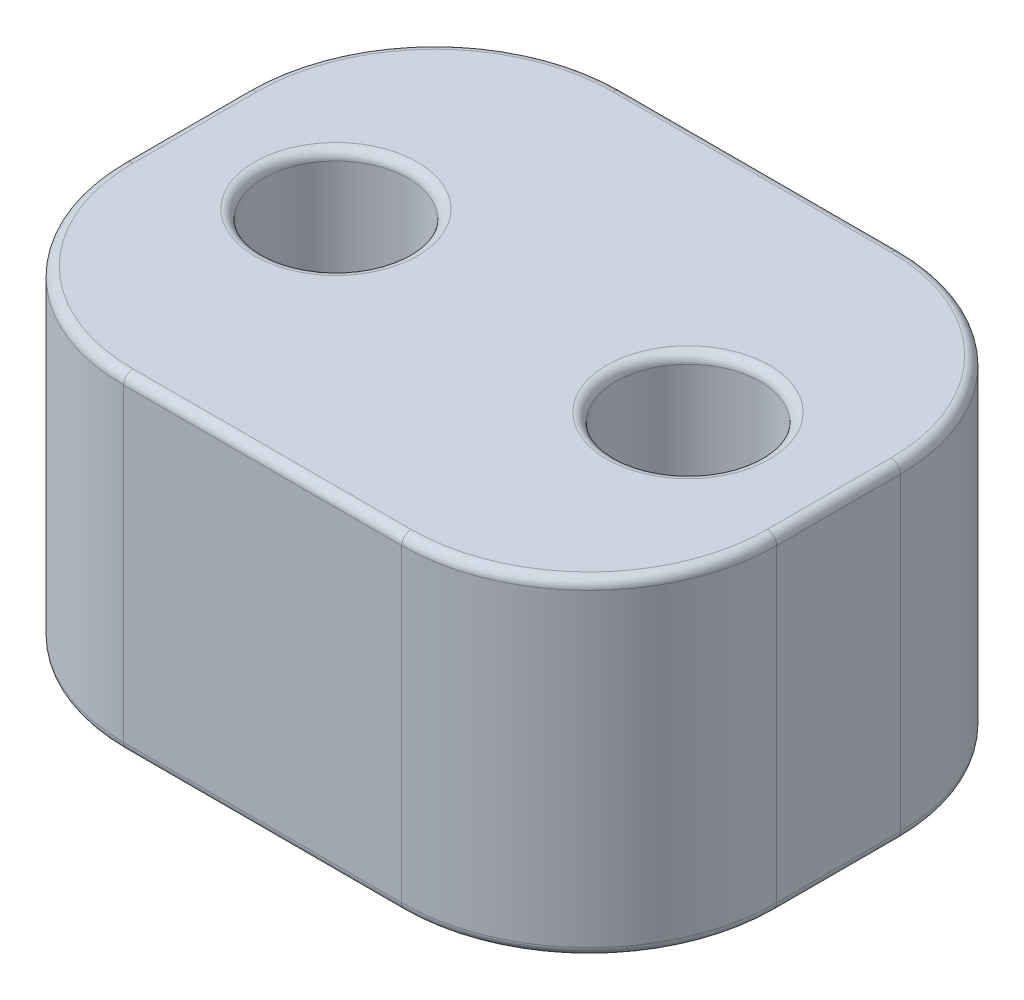
ISO-10303-21;
HEADER;
FILE_DESCRIPTION(('STEP AP214'),'2;1');
FILE_NAME('part.step','',(''),(''),'','','');
FILE_SCHEMA(('AUTOMOTIVE_DESIGN { 1 0 10303 214 1 1 1 1 }'));
ENDSEC;
DATA;
#1=APPLICATION_CONTEXT('core data for automotive mechanical design processes');
#2=APPLICATION_PROTOCOL_DEFINITION('international standard','automotive_design',2000,#1);
#3=PRODUCT_CONTEXT('',#1,'mechanical');
#4=PRODUCT('Part','Part','',(#3));
#5=PRODUCT_RELATED_PRODUCT_CATEGORY('part','',(#4));
#6=PRODUCT_DEFINITION_FORMATION('','',#4);
#7=PRODUCT_DEFINITION_CONTEXT('part definition',#1,'design');
#8=PRODUCT_DEFINITION('design','',#6,#7);
#9=PRODUCT_DEFINITION_SHAPE('','',#8);
#10=(LENGTH_UNIT() NAMED_UNIT(*) SI_UNIT(.MILLI.,.METRE.));
#11=(NAMED_UNIT(*) PLANE_ANGLE_UNIT() SI_UNIT($,.RADIAN.));
#12=(NAMED_UNIT(*) SI_UNIT($,.STERADIAN.) SOLID_ANGLE_UNIT());
#13=UNCERTAINTY_MEASURE_WITH_UNIT(LENGTH_MEASURE(1.E-05),#10,'distance_accuracy_value','');
#14=(GEOMETRIC_REPRESENTATION_CONTEXT(3) GLOBAL_UNCERTAINTY_ASSIGNED_CONTEXT((#13)) GLOBAL_UNIT_ASSIGNED_CONTEXT((#10,
#11,#12)) REPRESENTATION_CONTEXT('',''));
#15=CARTESIAN_POINT('',(0.,0.,0.));
#16=DIRECTION('',(0.,0.,1.));
#17=DIRECTION('',(1.,0.,0.));
#18=AXIS2_PLACEMENT_3D('',#15,#16,#17);
#19=CARTESIAN_POINT('',(0.939073469079084,0.825,2.73));
#20=DIRECTION('',(0.,-1.,0.));
#21=DIRECTION('',(0.,0.,-1.));
#22=AXIS2_PLACEMENT_3D('',#19,#20,#21);
#23=TOROIDAL_SURFACE('',#22,0.43452666740162,0.05);
#24=CARTESIAN_POINT('',(0.939073469079084,0.875,2.73));
#25=DIRECTION('',(0.,1.,0.));
#26=DIRECTION('',(1.,0.,0.));
#27=AXIS2_PLACEMENT_3D('',#24,#25,#26);
#28=CIRCLE('',#27,0.43452666740162);
#29=CARTESIAN_POINT('',(0.504546801677464,0.875,2.73));
#30=VERTEX_POINT('',#29);
#31=CARTESIAN_POINT('',(0.939073469079084,0.875,3.1645266674016));
#32=VERTEX_POINT('',#31);
#33=EDGE_CURVE('E11',#30,#32,#28,.T.);
#34=ORIENTED_EDGE('',*,*,#33,.T.);
#35=CARTESIAN_POINT('',(0.939073469079084,0.825,3.1645266674016));
#36=DIRECTION('',(-1.,0.,0.));
#37=DIRECTION('',(0.,0.,1.));
#38=AXIS2_PLACEMENT_3D('',#35,#36,#37);
#39=CIRCLE('',#38,0.05);
#40=CARTESIAN_POINT('',(0.939073469079084,0.825,3.1145266674016));
#41=VERTEX_POINT('',#40);
#42=EDGE_CURVE('E24',#32,#41,#39,.T.);
#43=ORIENTED_EDGE('',*,*,#42,.T.);
#44=CARTESIAN_POINT('',(0.939073469079084,0.825,2.73));
#45=DIRECTION('',(0.,-1.,0.));
#46=DIRECTION('',(1.,0.,0.));
#47=AXIS2_PLACEMENT_3D('',#44,#45,#46);
#48=CIRCLE('',#47,0.38452666740162);
#49=CARTESIAN_POINT('',(0.554546801677464,0.825,2.73));
#50=VERTEX_POINT('',#49);
#51=EDGE_CURVE('E396',#41,#50,#48,.T.);
#52=ORIENTED_EDGE('',*,*,#51,.T.);
#53=CARTESIAN_POINT('',(0.939073469079084,0.825,2.73));
#54=DIRECTION('',(0.,-1.,0.));
#55=DIRECTION('',(1.,0.,0.));
#56=AXIS2_PLACEMENT_3D('',#53,#54,#55);
#57=CIRCLE('',#56,0.38452666740162);
#58=EDGE_CURVE('E393',#50,#41,#57,.T.);
#59=ORIENTED_EDGE('',*,*,#58,.T.);
#60=ORIENTED_EDGE('',*,*,#42,.F.);
#61=CARTESIAN_POINT('',(0.939073469079084,0.875,2.73));
#62=DIRECTION('',(0.,1.,0.));
#63=DIRECTION('',(1.,0.,0.));
#64=AXIS2_PLACEMENT_3D('',#61,#62,#63);
#65=CIRCLE('',#64,0.43452666740162);
#66=EDGE_CURVE('E391',#32,#30,#65,.T.);
#67=ORIENTED_EDGE('',*,*,#66,.T.);
#68=EDGE_LOOP('',(#34,#43,#52,#59,#60,#67));
#69=FACE_BOUND('',#68,.T.);
#70=ADVANCED_FACE('F17',(#69),#23,.T.);
#71=CARTESIAN_POINT('',(0.939073469079084,0.,2.73));
#72=DIRECTION('',(0.,1.,0.));
#73=DIRECTION('',(1.,0.,0.));
#74=AXIS2_PLACEMENT_3D('',#71,#72,#73);
#75=CYLINDRICAL_SURFACE('',#74,0.38452666740162);
#76=ORIENTED_EDGE('',*,*,#58,.F.);
#77=DIRECTION('',(0.,-1.,0.));
#78=VECTOR('',#77,1.);
#79=CARTESIAN_POINT('',(0.554546801677464,0.,2.73));
#80=LINE('',#79,#78);
#81=CARTESIAN_POINT('',(0.554546801677464,-0.825,2.73));
#82=VERTEX_POINT('',#81);
#83=EDGE_CURVE('E389',#50,#82,#80,.T.);
#84=ORIENTED_EDGE('',*,*,#83,.T.);
#85=CARTESIAN_POINT('',(0.939073469079084,-0.825,2.73));
#86=DIRECTION('',(0.,1.,0.));
#87=DIRECTION('',(1.,0.,0.));
#88=AXIS2_PLACEMENT_3D('',#85,#86,#87);
#89=CIRCLE('',#88,0.38452666740162);
#90=CARTESIAN_POINT('',(0.939073469079084,-0.825,2.3454733325984));
#91=VERTEX_POINT('',#90);
#92=EDGE_CURVE('E386',#91,#82,#89,.T.);
#93=ORIENTED_EDGE('',*,*,#92,.F.);
#94=CARTESIAN_POINT('',(0.939073469079084,-0.825,2.73));
#95=DIRECTION('',(0.,1.,0.));
#96=DIRECTION('',(1.,0.,0.));
#97=AXIS2_PLACEMENT_3D('',#94,#95,#96);
#98=CIRCLE('',#97,0.38452666740162);
#99=EDGE_CURVE('E384',#82,#91,#98,.T.);
#100=ORIENTED_EDGE('',*,*,#99,.F.);
#101=ORIENTED_EDGE('',*,*,#83,.F.);
#102=ORIENTED_EDGE('',*,*,#51,.F.);
#103=EDGE_LOOP('',(#76,#84,#93,#100,#101,#102));
#104=FACE_BOUND('',#103,.T.);
#105=ADVANCED_FACE('F401',(#104),#75,.F.);
#106=CARTESIAN_POINT('',(0.,0.875,2.73));
#107=DIRECTION('',(0.,1.,0.));
#108=DIRECTION('',(0.,0.,1.));
#109=AXIS2_PLACEMENT_3D('',#106,#107,#108);
#110=PLANE('',#109);
#111=DIRECTION('',(0.,0.,-1.));
#112=VECTOR('',#111,1.);
#113=CARTESIAN_POINT('',(-1.6916886724432,0.875,2.565));
#114=LINE('',#113,#112);
#115=CARTESIAN_POINT('',(-1.6916886724432,0.875,3.06));
#116=VERTEX_POINT('',#115);
#117=CARTESIAN_POINT('',(-1.6916886724432,0.875,2.4));
#118=VERTEX_POINT('',#117);
#119=EDGE_CURVE('E382',#116,#118,#114,.T.);
#120=ORIENTED_EDGE('',*,*,#119,.F.);
#121=CARTESIAN_POINT('',(-0.741688672443182,0.875,3.06));
#122=DIRECTION('',(0.,-1.,0.));
#123=DIRECTION('',(-0.707106781186548,0.,0.707106781186547));
#124=AXIS2_PLACEMENT_3D('',#121,#122,#123);
#125=CIRCLE('',#124,0.95);
#126=CARTESIAN_POINT('',(-0.741688672443182,0.875,4.01));
#127=VERTEX_POINT('',#126);
#128=EDGE_CURVE('E379',#127,#116,#125,.T.);
#129=ORIENTED_EDGE('',*,*,#128,.F.);
#130=DIRECTION('',(-1.,0.,0.));
#131=VECTOR('',#130,1.);
#132=CARTESIAN_POINT('',(-0.370844336221591,0.875,4.01));
#133=LINE('',#132,#131);
#134=CARTESIAN_POINT('',(0.741688672443182,0.875,4.01));
#135=VERTEX_POINT('',#134);
#136=EDGE_CURVE('E376',#135,#127,#133,.T.);
#137=ORIENTED_EDGE('',*,*,#136,.F.);
#138=CARTESIAN_POINT('',(0.741688672443182,0.875,3.06));
#139=DIRECTION('',(0.,-1.,0.));
#140=DIRECTION('',(0.707106781186548,0.,0.707106781186547));
#141=AXIS2_PLACEMENT_3D('',#138,#139,#140);
#142=CIRCLE('',#141,0.95);
#143=CARTESIAN_POINT('',(1.6916886724432,0.875,3.06));
#144=VERTEX_POINT('',#143);
#145=EDGE_CURVE('E373',#144,#135,#142,.T.);
#146=ORIENTED_EDGE('',*,*,#145,.F.);
#147=DIRECTION('',(0.,0.,1.));
#148=VECTOR('',#147,1.);
#149=CARTESIAN_POINT('',(1.6916886724432,0.875,2.895));
#150=LINE('',#149,#148);
#151=CARTESIAN_POINT('',(1.6916886724432,0.875,2.4));
#152=VERTEX_POINT('',#151);
#153=EDGE_CURVE('E370',#152,#144,#150,.T.);
#154=ORIENTED_EDGE('',*,*,#153,.F.);
#155=CARTESIAN_POINT('',(0.741688672443182,0.875,2.4));
#156=DIRECTION('',(0.,-1.,0.));
#157=DIRECTION('',(0.707106781186548,0.,-0.707106781186548));
#158=AXIS2_PLACEMENT_3D('',#155,#156,#157);
#159=CIRCLE('',#158,0.95);
#160=CARTESIAN_POINT('',(0.741688672443182,0.875,1.45));
#161=VERTEX_POINT('',#160);
#162=EDGE_CURVE('E367',#161,#152,#159,.T.);
#163=ORIENTED_EDGE('',*,*,#162,.F.);
#164=DIRECTION('',(1.,0.,0.));
#165=VECTOR('',#164,1.);
#166=CARTESIAN_POINT('',(0.370844336221591,0.875,1.45));
#167=LINE('',#166,#165);
#168=CARTESIAN_POINT('',(-0.741688672443182,0.875,1.45));
#169=VERTEX_POINT('',#168);
#170=EDGE_CURVE('E364',#169,#161,#167,.T.);
#171=ORIENTED_EDGE('',*,*,#170,.F.);
#172=CARTESIAN_POINT('',(-0.741688672443182,0.875,2.4));
#173=DIRECTION('',(0.,-1.,0.));
#174=DIRECTION('',(-0.707106781186547,0.,-0.707106781186548));
#175=AXIS2_PLACEMENT_3D('',#172,#173,#174);
#176=CIRCLE('',#175,0.95);
#177=EDGE_CURVE('E361',#118,#169,#176,.T.);
#178=ORIENTED_EDGE('',*,*,#177,.F.);
#179=EDGE_LOOP('',(#120,#129,#137,#146,#154,#163,#171,#178));
#180=FACE_BOUND('',#179,.T.);
#181=CARTESIAN_POINT('',(-0.939073469079084,0.875,2.73));
#182=DIRECTION('',(0.,1.,0.));
#183=DIRECTION('',(1.,0.,0.));
#184=AXIS2_PLACEMENT_3D('',#181,#182,#183);
#185=CIRCLE('',#184,0.43452666740162);
#186=CARTESIAN_POINT('',(-1.3736001364807,0.875,2.73));
#187=VERTEX_POINT('',#186);
#188=CARTESIAN_POINT('',(-0.939073469079084,0.875,3.1645266674016));
#189=VERTEX_POINT('',#188);
#190=EDGE_CURVE('E359',#187,#189,#185,.T.);
#191=ORIENTED_EDGE('',*,*,#190,.F.);
#192=CARTESIAN_POINT('',(-0.939073469079084,0.875,2.73));
#193=DIRECTION('',(0.,1.,0.));
#194=DIRECTION('',(1.,0.,0.));
#195=AXIS2_PLACEMENT_3D('',#192,#193,#194);
#196=CIRCLE('',#195,0.43452666740162);
#197=EDGE_CURVE('E356',#189,#187,#196,.T.);
#198=ORIENTED_EDGE('',*,*,#197,.F.);
#199=EDGE_LOOP('',(#191,#198));
#200=FACE_BOUND('',#199,.T.);
#201=ORIENTED_EDGE('',*,*,#33,.F.);
#202=ORIENTED_EDGE('',*,*,#66,.F.);
#203=EDGE_LOOP('',(#201,#202));
#204=FACE_BOUND('',#203,.T.);
#205=ADVANCED_FACE('F422',(#180,#200,#204),#110,.T.);
#206=CARTESIAN_POINT('',(0.939073469079084,-0.825,2.73));
#207=DIRECTION('',(0.,1.,0.));
#208=DIRECTION('',(0.,0.,1.));
#209=AXIS2_PLACEMENT_3D('',#206,#207,#208);
#210=TOROIDAL_SURFACE('',#209,0.43452666740162,0.05);
#211=CARTESIAN_POINT('',(0.939073469079084,-0.875,2.73));
#212=DIRECTION('',(0.,-1.,0.));
#213=DIRECTION('',(1.,0.,0.));
#214=AXIS2_PLACEMENT_3D('',#211,#212,#213);
#215=CIRCLE('',#214,0.43452666740162);
#216=CARTESIAN_POINT('',(0.504546801677464,-0.875,2.73));
#217=VERTEX_POINT('',#216);
#218=CARTESIAN_POINT('',(0.939073469079084,-0.875,2.2954733325984));
#219=VERTEX_POINT('',#218);
#220=EDGE_CURVE('E354',#217,#219,#215,.T.);
#221=ORIENTED_EDGE('',*,*,#220,.T.);
#222=CARTESIAN_POINT('',(0.939073469079084,-0.825,2.2954733325984));
#223=DIRECTION('',(-1.,0.,0.));
#224=DIRECTION('',(0.,0.,-1.));
#225=AXIS2_PLACEMENT_3D('',#222,#223,#224);
#226=CIRCLE('',#225,0.05);
#227=EDGE_CURVE('E351',#219,#91,#226,.T.);
#228=ORIENTED_EDGE('',*,*,#227,.T.);
#229=ORIENTED_EDGE('',*,*,#92,.T.);
#230=ORIENTED_EDGE('',*,*,#99,.T.);
#231=ORIENTED_EDGE('',*,*,#227,.F.);
#232=CARTESIAN_POINT('',(0.939073469079084,-0.875,2.73));
#233=DIRECTION('',(0.,-1.,0.));
#234=DIRECTION('',(1.,0.,0.));
#235=AXIS2_PLACEMENT_3D('',#232,#233,#234);
#236=CIRCLE('',#235,0.43452666740162);
#237=EDGE_CURVE('E348',#219,#217,#236,.T.);
#238=ORIENTED_EDGE('',*,*,#237,.T.);
#239=EDGE_LOOP('',(#221,#228,#229,#230,#231,#238));
#240=FACE_BOUND('',#239,.T.);
#241=ADVANCED_FACE('F406',(#240),#210,.T.);
#242=CARTESIAN_POINT('',(0.,-0.875,2.73));
#243=DIRECTION('',(0.,1.,0.));
#244=DIRECTION('',(0.,0.,1.));
#245=AXIS2_PLACEMENT_3D('',#242,#243,#244);
#246=PLANE('',#245);
#247=DIRECTION('',(-1.,0.,0.));
#248=VECTOR('',#247,1.);
#249=CARTESIAN_POINT('',(0.370844336221591,-0.875,1.45));
#250=LINE('',#249,#248);
#251=CARTESIAN_POINT('',(0.741688672443182,-0.875,1.45));
#252=VERTEX_POINT('',#251);
#253=CARTESIAN_POINT('',(-0.741688672443182,-0.875,1.45));
#254=VERTEX_POINT('',#253);
#255=EDGE_CURVE('E346',#252,#254,#250,.T.);
#256=ORIENTED_EDGE('',*,*,#255,.F.);
#257=CARTESIAN_POINT('',(0.741688672443182,-0.875,2.4));
#258=DIRECTION('',(0.,1.,0.));
#259=DIRECTION('',(0.707106781186548,0.,-0.707106781186548));
#260=AXIS2_PLACEMENT_3D('',#257,#258,#259);
#261=CIRCLE('',#260,0.95);
#262=CARTESIAN_POINT('',(1.6916886724432,-0.875,2.4));
#263=VERTEX_POINT('',#262);
#264=EDGE_CURVE('E344',#263,#252,#261,.T.);
#265=ORIENTED_EDGE('',*,*,#264,.F.);
#266=DIRECTION('',(0.,0.,-1.));
#267=VECTOR('',#266,1.);
#268=CARTESIAN_POINT('',(1.6916886724432,-0.875,2.895));
#269=LINE('',#268,#267);
#270=CARTESIAN_POINT('',(1.6916886724432,-0.875,3.06));
#271=VERTEX_POINT('',#270);
#272=EDGE_CURVE('E180',#271,#263,#269,.T.);
#273=ORIENTED_EDGE('',*,*,#272,.F.);
#274=CARTESIAN_POINT('',(0.741688672443182,-0.875,3.06));
#275=DIRECTION('',(0.,1.,0.));
#276=DIRECTION('',(0.707106781186548,0.,0.707106781186547));
#277=AXIS2_PLACEMENT_3D('',#274,#275,#276);
#278=CIRCLE('',#277,0.95);
#279=CARTESIAN_POINT('',(0.741688672443182,-0.875,4.01));
#280=VERTEX_POINT('',#279);
#281=EDGE_CURVE('E340',#280,#271,#278,.T.);
#282=ORIENTED_EDGE('',*,*,#281,.F.);
#283=DIRECTION('',(1.,0.,0.));
#284=VECTOR('',#283,1.);
#285=CARTESIAN_POINT('',(-0.370844336221591,-0.875,4.01));
#286=LINE('',#285,#284);
#287=CARTESIAN_POINT('',(-0.741688672443182,-0.875,4.01));
#288=VERTEX_POINT('',#287);
#289=EDGE_CURVE('E337',#288,#280,#286,.T.);
#290=ORIENTED_EDGE('',*,*,#289,.F.);
#291=CARTESIAN_POINT('',(-0.741688672443182,-0.875,3.06));
#292=DIRECTION('',(0.,1.,0.));
#293=DIRECTION('',(-0.707106781186548,0.,0.707106781186547));
#294=AXIS2_PLACEMENT_3D('',#291,#292,#293);
#295=CIRCLE('',#294,0.95);
#296=CARTESIAN_POINT('',(-1.6916886724432,-0.875,3.06));
#297=VERTEX_POINT('',#296);
#298=EDGE_CURVE('E334',#297,#288,#295,.T.);
#299=ORIENTED_EDGE('',*,*,#298,.F.);
#300=DIRECTION('',(0.,0.,1.));
#301=VECTOR('',#300,1.);
#302=CARTESIAN_POINT('',(-1.6916886724432,-0.875,2.565));
#303=LINE('',#302,#301);
#304=CARTESIAN_POINT('',(-1.6916886724432,-0.875,2.4));
#305=VERTEX_POINT('',#304);
#306=EDGE_CURVE('E331',#305,#297,#303,.T.);
#307=ORIENTED_EDGE('',*,*,#306,.F.);
#308=CARTESIAN_POINT('',(-0.741688672443182,-0.875,2.4));
#309=DIRECTION('',(0.,1.,0.));
#310=DIRECTION('',(-0.707106781186547,0.,-0.707106781186548));
#311=AXIS2_PLACEMENT_3D('',#308,#309,#310);
#312=CIRCLE('',#311,0.95);
#313=EDGE_CURVE('E328',#254,#305,#312,.T.);
#314=ORIENTED_EDGE('',*,*,#313,.F.);
#315=EDGE_LOOP('',(#256,#265,#273,#282,#290,#299,#307,#314));
#316=FACE_BOUND('',#315,.T.);
#317=CARTESIAN_POINT('',(-0.939073469079084,-0.875,2.73));
#318=DIRECTION('',(0.,-1.,0.));
#319=DIRECTION('',(1.,0.,0.));
#320=AXIS2_PLACEMENT_3D('',#317,#318,#319);
#321=CIRCLE('',#320,0.43452666740162);
#322=CARTESIAN_POINT('',(-1.3736001364807,-0.875,2.73));
#323=VERTEX_POINT('',#322);
#324=CARTESIAN_POINT('',(-0.939073469079084,-0.875,2.2954733325984));
#325=VERTEX_POINT('',#324);
#326=EDGE_CURVE('E326',#323,#325,#321,.T.);
#327=ORIENTED_EDGE('',*,*,#326,.F.);
#328=CARTESIAN_POINT('',(-0.939073469079084,-0.875,2.73));
#329=DIRECTION('',(0.,-1.,0.));
#330=DIRECTION('',(1.,0.,0.));
#331=AXIS2_PLACEMENT_3D('',#328,#329,#330);
#332=CIRCLE('',#331,0.43452666740162);
#333=EDGE_CURVE('E323',#325,#323,#332,.T.);
#334=ORIENTED_EDGE('',*,*,#333,.F.);
#335=EDGE_LOOP('',(#327,#334));
#336=FACE_BOUND('',#335,.T.);
#337=ORIENTED_EDGE('',*,*,#220,.F.);
#338=ORIENTED_EDGE('',*,*,#237,.F.);
#339=EDGE_LOOP('',(#337,#338));
#340=FACE_BOUND('',#339,.T.);
#341=ADVANCED_FACE('F409',(#316,#336,#340),#246,.F.);
#342=CARTESIAN_POINT('',(-0.939073469079084,-0.825,2.73));
#343=DIRECTION('',(0.,1.,0.));
#344=DIRECTION('',(0.,0.,1.));
#345=AXIS2_PLACEMENT_3D('',#342,#343,#344);
#346=TOROIDAL_SURFACE('',#345,0.43452666740162,0.05);
#347=ORIENTED_EDGE('',*,*,#326,.T.);
#348=CARTESIAN_POINT('',(-0.939073469079084,-0.825,2.2954733325984));
#349=DIRECTION('',(-1.,0.,0.));
#350=DIRECTION('',(0.,0.,-1.));
#351=AXIS2_PLACEMENT_3D('',#348,#349,#350);
#352=CIRCLE('',#351,0.05);
#353=CARTESIAN_POINT('',(-0.939073469079084,-0.825,2.3454733325984));
#354=VERTEX_POINT('',#353);
#355=EDGE_CURVE('E321',#325,#354,#352,.T.);
#356=ORIENTED_EDGE('',*,*,#355,.T.);
#357=CARTESIAN_POINT('',(-0.939073469079084,-0.825,2.73));
#358=DIRECTION('',(0.,1.,0.));
#359=DIRECTION('',(1.,0.,0.));
#360=AXIS2_PLACEMENT_3D('',#357,#358,#359);
#361=CIRCLE('',#360,0.38452666740162);
#362=CARTESIAN_POINT('',(-1.3236001364807,-0.825,2.73));
#363=VERTEX_POINT('',#362);
#364=EDGE_CURVE('E319',#354,#363,#361,.T.);
#365=ORIENTED_EDGE('',*,*,#364,.T.);
#366=CARTESIAN_POINT('',(-0.939073469079084,-0.825,2.73));
#367=DIRECTION('',(0.,1.,0.));
#368=DIRECTION('',(1.,0.,0.));
#369=AXIS2_PLACEMENT_3D('',#366,#367,#368);
#370=CIRCLE('',#369,0.38452666740162);
#371=EDGE_CURVE('E316',#363,#354,#370,.T.);
#372=ORIENTED_EDGE('',*,*,#371,.T.);
#373=ORIENTED_EDGE('',*,*,#355,.F.);
#374=ORIENTED_EDGE('',*,*,#333,.T.);
#375=EDGE_LOOP('',(#347,#356,#365,#372,#373,#374));
#376=FACE_BOUND('',#375,.T.);
#377=ADVANCED_FACE('F411',(#376),#346,.T.);
#378=CARTESIAN_POINT('',(-0.939073469079084,0.,2.73));
#379=DIRECTION('',(0.,1.,0.));
#380=DIRECTION('',(1.,0.,0.));
#381=AXIS2_PLACEMENT_3D('',#378,#379,#380);
#382=CYLINDRICAL_SURFACE('',#381,0.38452666740162);
#383=CARTESIAN_POINT('',(-0.939073469079084,0.825,2.73));
#384=DIRECTION('',(0.,-1.,0.));
#385=DIRECTION('',(1.,0.,0.));
#386=AXIS2_PLACEMENT_3D('',#383,#384,#385);
#387=CIRCLE('',#386,0.38452666740162);
#388=CARTESIAN_POINT('',(-1.3236001364807,0.825,2.73));
#389=VERTEX_POINT('',#388);
#390=CARTESIAN_POINT('',(-0.939073469079084,0.825,3.1145266674016));
#391=VERTEX_POINT('',#390);
#392=EDGE_CURVE('E313',#389,#391,#387,.T.);
#393=ORIENTED_EDGE('',*,*,#392,.F.);
#394=DIRECTION('',(0.,-1.,0.));
#395=VECTOR('',#394,1.);
#396=CARTESIAN_POINT('',(-1.3236001364807,0.,2.73));
#397=LINE('',#396,#395);
#398=EDGE_CURVE('E310',#389,#363,#397,.T.);
#399=ORIENTED_EDGE('',*,*,#398,.T.);
#400=ORIENTED_EDGE('',*,*,#364,.F.);
#401=ORIENTED_EDGE('',*,*,#371,.F.);
#402=ORIENTED_EDGE('',*,*,#398,.F.);
#403=CARTESIAN_POINT('',(-0.939073469079084,0.825,2.73));
#404=DIRECTION('',(0.,-1.,0.));
#405=DIRECTION('',(1.,0.,0.));
#406=AXIS2_PLACEMENT_3D('',#403,#404,#405);
#407=CIRCLE('',#406,0.38452666740162);
#408=EDGE_CURVE('E308',#391,#389,#407,.T.);
#409=ORIENTED_EDGE('',*,*,#408,.F.);
#410=EDGE_LOOP('',(#393,#399,#400,#401,#402,#409));
#411=FACE_BOUND('',#410,.T.);
#412=ADVANCED_FACE('F419',(#411),#382,.F.);
#413=CARTESIAN_POINT('',(-0.939073469079084,0.825,2.73));
#414=DIRECTION('',(0.,-1.,0.));
#415=DIRECTION('',(0.,0.,-1.));
#416=AXIS2_PLACEMENT_3D('',#413,#414,#415);
#417=TOROIDAL_SURFACE('',#416,0.43452666740162,0.05);
#418=ORIENTED_EDGE('',*,*,#190,.T.);
#419=CARTESIAN_POINT('',(-0.939073469079084,0.825,3.1645266674016));
#420=DIRECTION('',(-1.,0.,0.));
#421=DIRECTION('',(0.,0.,1.));
#422=AXIS2_PLACEMENT_3D('',#419,#420,#421);
#423=CIRCLE('',#422,0.05);
#424=EDGE_CURVE('E305',#189,#391,#423,.T.);
#425=ORIENTED_EDGE('',*,*,#424,.T.);
#426=ORIENTED_EDGE('',*,*,#408,.T.);
#427=ORIENTED_EDGE('',*,*,#392,.T.);
#428=ORIENTED_EDGE('',*,*,#424,.F.);
#429=ORIENTED_EDGE('',*,*,#197,.T.);
#430=EDGE_LOOP('',(#418,#425,#426,#427,#428,#429));
#431=FACE_BOUND('',#430,.T.);
#432=ADVANCED_FACE('F441',(#431),#417,.T.);
#433=CARTESIAN_POINT('',(-1.6916886724432,0.825,2.565));
#434=DIRECTION('',(0.,0.,1.));
#435=DIRECTION('',(-0.707106781186548,0.707106781186548,0.));
#436=AXIS2_PLACEMENT_3D('',#433,#434,#435);
#437=CYLINDRICAL_SURFACE('',#436,0.05);
#438=CARTESIAN_POINT('',(-1.6916886724432,0.825,2.4));
#439=DIRECTION('',(0.,0.,1.));
#440=DIRECTION('',(0.,1.,0.));
#441=AXIS2_PLACEMENT_3D('',#438,#439,#440);
#442=CIRCLE('',#441,0.05);
#443=CARTESIAN_POINT('',(-1.7416886724432,0.825,2.4));
#444=VERTEX_POINT('',#443);
#445=EDGE_CURVE('E303',#118,#444,#442,.T.);
#446=ORIENTED_EDGE('',*,*,#445,.T.);
#447=DIRECTION('',(0.,0.,1.));
#448=VECTOR('',#447,1.);
#449=CARTESIAN_POINT('',(-1.7416886724432,0.825,2.565));
#450=LINE('',#449,#448);
#451=CARTESIAN_POINT('',(-1.7416886724432,0.825,3.06));
#452=VERTEX_POINT('',#451);
#453=EDGE_CURVE('E301',#444,#452,#450,.T.);
#454=ORIENTED_EDGE('',*,*,#453,.T.);
#455=CARTESIAN_POINT('',(-1.6916886724432,0.825,3.06));
#456=DIRECTION('',(0.,0.,-1.));
#457=DIRECTION('',(-1.,0.,0.));
#458=AXIS2_PLACEMENT_3D('',#455,#456,#457);
#459=CIRCLE('',#458,0.05);
#460=EDGE_CURVE('E298',#452,#116,#459,.T.);
#461=ORIENTED_EDGE('',*,*,#460,.T.);
#462=ORIENTED_EDGE('',*,*,#119,.T.);
#463=EDGE_LOOP('',(#446,#454,#461,#462));
#464=FACE_BOUND('',#463,.T.);
#465=ADVANCED_FACE('F454',(#464),#437,.T.);
#466=CARTESIAN_POINT('',(-0.741688672443182,0.825,3.06));
#467=DIRECTION('',(0.,1.,0.));
#468=DIRECTION('',(0.,0.,1.));
#469=AXIS2_PLACEMENT_3D('',#466,#467,#468);
#470=TOROIDAL_SURFACE('',#469,0.95,0.05);
#471=CARTESIAN_POINT('',(-0.741688672443182,0.825,4.01));
#472=DIRECTION('',(-1.,0.,0.));
#473=DIRECTION('',(0.,0.,1.));
#474=AXIS2_PLACEMENT_3D('',#471,#472,#473);
#475=CIRCLE('',#474,0.05);
#476=CARTESIAN_POINT('',(-0.741688672443182,0.825,4.06));
#477=VERTEX_POINT('',#476);
#478=EDGE_CURVE('E295',#477,#127,#475,.T.);
#479=ORIENTED_EDGE('',*,*,#478,.T.);
#480=ORIENTED_EDGE('',*,*,#128,.T.);
#481=ORIENTED_EDGE('',*,*,#460,.F.);
#482=CARTESIAN_POINT('',(-0.741688672443182,0.825,3.06));
#483=DIRECTION('',(0.,1.,0.));
#484=DIRECTION('',(-0.707106781186548,0.,0.707106781186547));
#485=AXIS2_PLACEMENT_3D('',#482,#483,#484);
#486=CIRCLE('',#485,1.);
#487=EDGE_CURVE('E292',#452,#477,#486,.T.);
#488=ORIENTED_EDGE('',*,*,#487,.T.);
#489=EDGE_LOOP('',(#479,#480,#481,#488));
#490=FACE_BOUND('',#489,.T.);
#491=ADVANCED_FACE('F459',(#490),#470,.T.);
#492=CARTESIAN_POINT('',(-0.370844336221591,0.825,4.01));
#493=DIRECTION('',(1.,0.,0.));
#494=DIRECTION('',(0.,0.707106781186548,0.707106781186548));
#495=AXIS2_PLACEMENT_3D('',#492,#493,#494);
#496=CYLINDRICAL_SURFACE('',#495,0.05);
#497=CARTESIAN_POINT('',(0.741688672443182,0.825,4.01));
#498=DIRECTION('',(-1.,0.,0.));
#499=DIRECTION('',(0.,0.,1.));
#500=AXIS2_PLACEMENT_3D('',#497,#498,#499);
#501=CIRCLE('',#500,0.05);
#502=CARTESIAN_POINT('',(0.741688672443182,0.825,4.06));
#503=VERTEX_POINT('',#502);
#504=EDGE_CURVE('E289',#503,#135,#501,.T.);
#505=ORIENTED_EDGE('',*,*,#504,.T.);
#506=ORIENTED_EDGE('',*,*,#136,.T.);
#507=ORIENTED_EDGE('',*,*,#478,.F.);
#508=DIRECTION('',(1.,0.,0.));
#509=VECTOR('',#508,1.);
#510=CARTESIAN_POINT('',(-0.370844336221591,0.825,4.06));
#511=LINE('',#510,#509);
#512=EDGE_CURVE('E286',#477,#503,#511,.T.);
#513=ORIENTED_EDGE('',*,*,#512,.T.);
#514=EDGE_LOOP('',(#505,#506,#507,#513));
#515=FACE_BOUND('',#514,.T.);
#516=ADVANCED_FACE('F463',(#515),#496,.T.);
#517=CARTESIAN_POINT('',(0.741688672443182,0.825,3.06));
#518=DIRECTION('',(0.,1.,0.));
#519=DIRECTION('',(0.,0.,1.));
#520=AXIS2_PLACEMENT_3D('',#517,#518,#519);
#521=TOROIDAL_SURFACE('',#520,0.95,0.05);
#522=CARTESIAN_POINT('',(1.6916886724432,0.825,3.06));
#523=DIRECTION('',(0.,0.,1.));
#524=DIRECTION('',(1.,0.,0.));
#525=AXIS2_PLACEMENT_3D('',#522,#523,#524);
#526=CIRCLE('',#525,0.05);
#527=CARTESIAN_POINT('',(1.7416886724432,0.825,3.06));
#528=VERTEX_POINT('',#527);
#529=EDGE_CURVE('E283',#528,#144,#526,.T.);
#530=ORIENTED_EDGE('',*,*,#529,.T.);
#531=ORIENTED_EDGE('',*,*,#145,.T.);
#532=ORIENTED_EDGE('',*,*,#504,.F.);
#533=CARTESIAN_POINT('',(0.741688672443182,0.825,3.06));
#534=DIRECTION('',(0.,1.,0.));
#535=DIRECTION('',(0.707106781186548,0.,0.707106781186547));
#536=AXIS2_PLACEMENT_3D('',#533,#534,#535);
#537=CIRCLE('',#536,1.);
#538=EDGE_CURVE('E280',#503,#528,#537,.T.);
#539=ORIENTED_EDGE('',*,*,#538,.T.);
#540=EDGE_LOOP('',(#530,#531,#532,#539));
#541=FACE_BOUND('',#540,.T.);
#542=ADVANCED_FACE('F467',(#541),#521,.T.);
#543=CARTESIAN_POINT('',(1.6916886724432,0.825,2.895));
#544=DIRECTION('',(0.,0.,-1.));
#545=DIRECTION('',(0.707106781186548,0.707106781186548,0.));
#546=AXIS2_PLACEMENT_3D('',#543,#544,#545);
#547=CYLINDRICAL_SURFACE('',#546,0.05);
#548=CARTESIAN_POINT('',(1.6916886724432,0.825,2.4));
#549=DIRECTION('',(0.,0.,1.));
#550=DIRECTION('',(1.,0.,0.));
#551=AXIS2_PLACEMENT_3D('',#548,#549,#550);
#552=CIRCLE('',#551,0.05);
#553=CARTESIAN_POINT('',(1.7416886724432,0.825,2.4));
#554=VERTEX_POINT('',#553);
#555=EDGE_CURVE('E277',#554,#152,#552,.T.);
#556=ORIENTED_EDGE('',*,*,#555,.T.);
#557=ORIENTED_EDGE('',*,*,#153,.T.);
#558=ORIENTED_EDGE('',*,*,#529,.F.);
#559=DIRECTION('',(0.,0.,-1.));
#560=VECTOR('',#559,1.);
#561=CARTESIAN_POINT('',(1.7416886724432,0.825,2.895));
#562=LINE('',#561,#560);
#563=EDGE_CURVE('E274',#528,#554,#562,.T.);
#564=ORIENTED_EDGE('',*,*,#563,.T.);
#565=EDGE_LOOP('',(#556,#557,#558,#564));
#566=FACE_BOUND('',#565,.T.);
#567=ADVANCED_FACE('F471',(#566),#547,.T.);
#568=CARTESIAN_POINT('',(0.741688672443182,0.825,2.4));
#569=DIRECTION('',(0.,1.,0.));
#570=DIRECTION('',(0.,0.,1.));
#571=AXIS2_PLACEMENT_3D('',#568,#569,#570);
#572=TOROIDAL_SURFACE('',#571,0.95,0.05);
#573=CARTESIAN_POINT('',(0.741688672443182,0.825,1.45));
#574=DIRECTION('',(1.,0.,0.));
#575=DIRECTION('',(0.,0.,-1.));
#576=AXIS2_PLACEMENT_3D('',#573,#574,#575);
#577=CIRCLE('',#576,0.05);
#578=CARTESIAN_POINT('',(0.741688672443182,0.825,1.4));
#579=VERTEX_POINT('',#578);
#580=EDGE_CURVE('E271',#579,#161,#577,.T.);
#581=ORIENTED_EDGE('',*,*,#580,.T.);
#582=ORIENTED_EDGE('',*,*,#162,.T.);
#583=ORIENTED_EDGE('',*,*,#555,.F.);
#584=CARTESIAN_POINT('',(0.741688672443182,0.825,2.4));
#585=DIRECTION('',(0.,1.,0.));
#586=DIRECTION('',(0.707106781186548,0.,-0.707106781186548));
#587=AXIS2_PLACEMENT_3D('',#584,#585,#586);
#588=CIRCLE('',#587,1.);
#589=EDGE_CURVE('E210',#554,#579,#588,.T.);
#590=ORIENTED_EDGE('',*,*,#589,.T.);
#591=EDGE_LOOP('',(#581,#582,#583,#590));
#592=FACE_BOUND('',#591,.T.);
#593=ADVANCED_FACE('F475',(#592),#572,.T.);
#594=CARTESIAN_POINT('',(0.370844336221591,0.825,1.45));
#595=DIRECTION('',(-1.,0.,0.));
#596=DIRECTION('',(0.,0.707106781186548,-0.707106781186548));
#597=AXIS2_PLACEMENT_3D('',#594,#595,#596);
#598=CYLINDRICAL_SURFACE('',#597,0.05);
#599=CARTESIAN_POINT('',(-0.741688672443182,0.825,1.45));
#600=DIRECTION('',(1.,0.,0.));
#601=DIRECTION('',(0.,0.,-1.));
#602=AXIS2_PLACEMENT_3D('',#599,#600,#601);
#603=CIRCLE('',#602,0.05);
#604=CARTESIAN_POINT('',(-0.741688672443182,0.825,1.4));
#605=VERTEX_POINT('',#604);
#606=EDGE_CURVE('E267',#605,#169,#603,.T.);
#607=ORIENTED_EDGE('',*,*,#606,.T.);
#608=ORIENTED_EDGE('',*,*,#170,.T.);
#609=ORIENTED_EDGE('',*,*,#580,.F.);
#610=DIRECTION('',(-1.,0.,0.));
#611=VECTOR('',#610,1.);
#612=CARTESIAN_POINT('',(0.370844336221591,0.825,1.4));
#613=LINE('',#612,#611);
#614=EDGE_CURVE('E264',#579,#605,#613,.T.);
#615=ORIENTED_EDGE('',*,*,#614,.T.);
#616=EDGE_LOOP('',(#607,#608,#609,#615));
#617=FACE_BOUND('',#616,.T.);
#618=ADVANCED_FACE('F479',(#617),#598,.T.);
#619=CARTESIAN_POINT('',(-0.741688672443182,0.825,2.4));
#620=DIRECTION('',(0.,1.,0.));
#621=DIRECTION('',(0.,0.,1.));
#622=AXIS2_PLACEMENT_3D('',#619,#620,#621);
#623=TOROIDAL_SURFACE('',#622,0.95,0.05);
#624=ORIENTED_EDGE('',*,*,#445,.F.);
#625=ORIENTED_EDGE('',*,*,#177,.T.);
#626=ORIENTED_EDGE('',*,*,#606,.F.);
#627=CARTESIAN_POINT('',(-0.741688672443182,0.825,2.4));
#628=DIRECTION('',(0.,1.,0.));
#629=DIRECTION('',(-0.707106781186547,0.,-0.707106781186548));
#630=AXIS2_PLACEMENT_3D('',#627,#628,#629);
#631=CIRCLE('',#630,1.);
#632=EDGE_CURVE('E261',#605,#444,#631,.T.);
#633=ORIENTED_EDGE('',*,*,#632,.T.);
#634=EDGE_LOOP('',(#624,#625,#626,#633));
#635=FACE_BOUND('',#634,.T.);
#636=ADVANCED_FACE('F483',(#635),#623,.T.);
#637=CARTESIAN_POINT('',(0.741688672443182,0.,3.06));
#638=DIRECTION('',(0.,1.,0.));
#639=DIRECTION('',(0.,0.,1.));
#640=AXIS2_PLACEMENT_3D('',#637,#638,#639);
#641=CYLINDRICAL_SURFACE('',#640,1.);
#642=ORIENTED_EDGE('',*,*,#538,.F.);
#643=DIRECTION('',(0.,1.,0.));
#644=VECTOR('',#643,1.);
#645=CARTESIAN_POINT('',(0.741688672443182,0.,4.06));
#646=LINE('',#645,#644);
#647=CARTESIAN_POINT('',(0.741688672443182,-0.825,4.06));
#648=VERTEX_POINT('',#647);
#649=EDGE_CURVE('E258',#648,#503,#646,.T.);
#650=ORIENTED_EDGE('',*,*,#649,.F.);
#651=CARTESIAN_POINT('',(0.741688672443182,-0.825,3.06));
#652=DIRECTION('',(0.,-1.,0.));
#653=DIRECTION('',(0.707106781186548,0.,0.707106781186547));
#654=AXIS2_PLACEMENT_3D('',#651,#652,#653);
#655=CIRCLE('',#654,1.);
#656=CARTESIAN_POINT('',(1.7416886724432,-0.825,3.06));
#657=VERTEX_POINT('',#656);
#658=EDGE_CURVE('E255',#657,#648,#655,.T.);
#659=ORIENTED_EDGE('',*,*,#658,.F.);
#660=DIRECTION('',(0.,1.,0.));
#661=VECTOR('',#660,1.);
#662=CARTESIAN_POINT('',(1.7416886724432,0.,3.06));
#663=LINE('',#662,#661);
#664=EDGE_CURVE('E203',#657,#528,#663,.T.);
#665=ORIENTED_EDGE('',*,*,#664,.T.);
#666=EDGE_LOOP('',(#642,#650,#659,#665));
#667=FACE_BOUND('',#666,.T.);
#668=ADVANCED_FACE('F487',(#667),#641,.T.);
#669=CARTESIAN_POINT('',(-0.741688672443182,0.,4.06));
#670=DIRECTION('',(0.,0.,1.));
#671=DIRECTION('',(1.,0.,0.));
#672=AXIS2_PLACEMENT_3D('',#669,#670,#671);
#673=PLANE('',#672);
#674=ORIENTED_EDGE('',*,*,#512,.F.);
#675=DIRECTION('',(0.,-1.,0.));
#676=VECTOR('',#675,1.);
#677=CARTESIAN_POINT('',(-0.741688672443182,0.,4.06));
#678=LINE('',#677,#676);
#679=CARTESIAN_POINT('',(-0.741688672443182,-0.825,4.06));
#680=VERTEX_POINT('',#679);
#681=EDGE_CURVE('E252',#477,#680,#678,.T.);
#682=ORIENTED_EDGE('',*,*,#681,.T.);
#683=DIRECTION('',(-1.,0.,0.));
#684=VECTOR('',#683,1.);
#685=CARTESIAN_POINT('',(-0.370844336221591,-0.825,4.06));
#686=LINE('',#685,#684);
#687=EDGE_CURVE('E249',#648,#680,#686,.T.);
#688=ORIENTED_EDGE('',*,*,#687,.F.);
#689=ORIENTED_EDGE('',*,*,#649,.T.);
#690=EDGE_LOOP('',(#674,#682,#688,#689));
#691=FACE_BOUND('',#690,.T.);
#692=ADVANCED_FACE('F491',(#691),#673,.T.);
#693=CARTESIAN_POINT('',(-0.741688672443182,0.,3.06));
#694=DIRECTION('',(0.,1.,0.));
#695=DIRECTION('',(-1.,0.,0.));
#696=AXIS2_PLACEMENT_3D('',#693,#694,#695);
#697=CYLINDRICAL_SURFACE('',#696,1.);
#698=ORIENTED_EDGE('',*,*,#487,.F.);
#699=DIRECTION('',(0.,1.,0.));
#700=VECTOR('',#699,1.);
#701=CARTESIAN_POINT('',(-1.7416886724432,0.,3.06));
#702=LINE('',#701,#700);
#703=CARTESIAN_POINT('',(-1.7416886724432,-0.825,3.06));
#704=VERTEX_POINT('',#703);
#705=EDGE_CURVE('E246',#704,#452,#702,.T.);
#706=ORIENTED_EDGE('',*,*,#705,.F.);
#707=CARTESIAN_POINT('',(-0.741688672443182,-0.825,3.06));
#708=DIRECTION('',(0.,-1.,0.));
#709=DIRECTION('',(-0.707106781186548,0.,0.707106781186547));
#710=AXIS2_PLACEMENT_3D('',#707,#708,#709);
#711=CIRCLE('',#710,1.);
#712=EDGE_CURVE('E243',#680,#704,#711,.T.);
#713=ORIENTED_EDGE('',*,*,#712,.F.);
#714=ORIENTED_EDGE('',*,*,#681,.F.);
#715=EDGE_LOOP('',(#698,#706,#713,#714));
#716=FACE_BOUND('',#715,.T.);
#717=ADVANCED_FACE('F495',(#716),#697,.T.);
#718=CARTESIAN_POINT('',(-1.7416886724432,0.,2.4));
#719=DIRECTION('',(-1.,0.,0.));
#720=DIRECTION('',(0.,0.,1.));
#721=AXIS2_PLACEMENT_3D('',#718,#719,#720);
#722=PLANE('',#721);
#723=ORIENTED_EDGE('',*,*,#453,.F.);
#724=DIRECTION('',(0.,1.,0.));
#725=VECTOR('',#724,1.);
#726=CARTESIAN_POINT('',(-1.7416886724432,0.,2.4));
#727=LINE('',#726,#725);
#728=CARTESIAN_POINT('',(-1.7416886724432,-0.825,2.4));
#729=VERTEX_POINT('',#728);
#730=EDGE_CURVE('E240',#729,#444,#727,.T.);
#731=ORIENTED_EDGE('',*,*,#730,.F.);
#732=DIRECTION('',(0.,0.,-1.));
#733=VECTOR('',#732,1.);
#734=CARTESIAN_POINT('',(-1.7416886724432,-0.825,2.565));
#735=LINE('',#734,#733);
#736=EDGE_CURVE('E237',#704,#729,#735,.T.);
#737=ORIENTED_EDGE('',*,*,#736,.F.);
#738=ORIENTED_EDGE('',*,*,#705,.T.);
#739=EDGE_LOOP('',(#723,#731,#737,#738));
#740=FACE_BOUND('',#739,.T.);
#741=ADVANCED_FACE('F499',(#740),#722,.T.);
#742=CARTESIAN_POINT('',(0.370844336221591,-0.825,1.45));
#743=DIRECTION('',(1.,0.,0.));
#744=DIRECTION('',(0.,-0.707106781186548,-0.707106781186548));
#745=AXIS2_PLACEMENT_3D('',#742,#743,#744);
#746=CYLINDRICAL_SURFACE('',#745,0.05);
#747=CARTESIAN_POINT('',(-0.741688672443182,-0.825,1.45));
#748=DIRECTION('',(1.,0.,0.));
#749=DIRECTION('',(0.,-1.,0.));
#750=AXIS2_PLACEMENT_3D('',#747,#748,#749);
#751=CIRCLE('',#750,0.05);
#752=CARTESIAN_POINT('',(-0.741688672443182,-0.825,1.4));
#753=VERTEX_POINT('',#752);
#754=EDGE_CURVE('E235',#254,#753,#751,.T.);
#755=ORIENTED_EDGE('',*,*,#754,.T.);
#756=DIRECTION('',(1.,0.,0.));
#757=VECTOR('',#756,1.);
#758=CARTESIAN_POINT('',(0.370844336221591,-0.825,1.4));
#759=LINE('',#758,#757);
#760=CARTESIAN_POINT('',(0.741688672443182,-0.825,1.4));
#761=VERTEX_POINT('',#760);
#762=EDGE_CURVE('E233',#753,#761,#759,.T.);
#763=ORIENTED_EDGE('',*,*,#762,.T.);
#764=CARTESIAN_POINT('',(0.741688672443182,-0.825,1.45));
#765=DIRECTION('',(-1.,0.,0.));
#766=DIRECTION('',(0.,0.,-1.));
#767=AXIS2_PLACEMENT_3D('',#764,#765,#766);
#768=CIRCLE('',#767,0.05);
#769=EDGE_CURVE('E183',#761,#252,#768,.T.);
#770=ORIENTED_EDGE('',*,*,#769,.T.);
#771=ORIENTED_EDGE('',*,*,#255,.T.);
#772=EDGE_LOOP('',(#755,#763,#770,#771));
#773=FACE_BOUND('',#772,.T.);
#774=ADVANCED_FACE('F503',(#773),#746,.T.);
#775=CARTESIAN_POINT('',(0.741688672443182,-0.825,2.4));
#776=DIRECTION('',(0.,-1.,0.));
#777=DIRECTION('',(0.,0.,-1.));
#778=AXIS2_PLACEMENT_3D('',#775,#776,#777);
#779=TOROIDAL_SURFACE('',#778,0.95,0.05);
#780=CARTESIAN_POINT('',(1.6916886724432,-0.825,2.4));
#781=DIRECTION('',(0.,0.,-1.));
#782=DIRECTION('',(1.,0.,0.));
#783=AXIS2_PLACEMENT_3D('',#780,#781,#782);
#784=CIRCLE('',#783,0.05);
#785=CARTESIAN_POINT('',(1.7416886724432,-0.825,2.4));
#786=VERTEX_POINT('',#785);
#787=EDGE_CURVE('E174',#786,#263,#784,.T.);
#788=ORIENTED_EDGE('',*,*,#787,.T.);
#789=ORIENTED_EDGE('',*,*,#264,.T.);
#790=ORIENTED_EDGE('',*,*,#769,.F.);
#791=CARTESIAN_POINT('',(0.741688672443182,-0.825,2.4));
#792=DIRECTION('',(0.,-1.,0.));
#793=DIRECTION('',(0.707106781186548,0.,-0.707106781186548));
#794=AXIS2_PLACEMENT_3D('',#791,#792,#793);
#795=CIRCLE('',#794,1.);
#796=EDGE_CURVE('E184',#761,#786,#795,.T.);
#797=ORIENTED_EDGE('',*,*,#796,.T.);
#798=EDGE_LOOP('',(#788,#789,#790,#797));
#799=FACE_BOUND('',#798,.T.);
#800=ADVANCED_FACE('F188',(#799),#779,.T.);
#801=CARTESIAN_POINT('',(1.6916886724432,-0.825,2.895));
#802=DIRECTION('',(0.,0.,1.));
#803=DIRECTION('',(0.707106781186548,-0.707106781186548,0.));
#804=AXIS2_PLACEMENT_3D('',#801,#802,#803);
#805=CYLINDRICAL_SURFACE('',#804,0.05);
#806=CARTESIAN_POINT('',(1.6916886724432,-0.825,3.06));
#807=DIRECTION('',(0.,0.,-1.));
#808=DIRECTION('',(1.,0.,0.));
#809=AXIS2_PLACEMENT_3D('',#806,#807,#808);
#810=CIRCLE('',#809,0.05);
#811=EDGE_CURVE('E194',#657,#271,#810,.T.);
#812=ORIENTED_EDGE('',*,*,#811,.T.);
#813=ORIENTED_EDGE('',*,*,#272,.T.);
#814=ORIENTED_EDGE('',*,*,#787,.F.);
#815=DIRECTION('',(0.,0.,1.));
#816=VECTOR('',#815,1.);
#817=CARTESIAN_POINT('',(1.7416886724432,-0.825,2.895));
#818=LINE('',#817,#816);
#819=EDGE_CURVE('E179',#786,#657,#818,.T.);
#820=ORIENTED_EDGE('',*,*,#819,.T.);
#821=EDGE_LOOP('',(#812,#813,#814,#820));
#822=FACE_BOUND('',#821,.T.);
#823=ADVANCED_FACE('F177',(#822),#805,.T.);
#824=CARTESIAN_POINT('',(0.741688672443182,-0.825,3.06));
#825=DIRECTION('',(0.,-1.,0.));
#826=DIRECTION('',(0.,0.,-1.));
#827=AXIS2_PLACEMENT_3D('',#824,#825,#826);
#828=TOROIDAL_SURFACE('',#827,0.95,0.05);
#829=CARTESIAN_POINT('',(0.741688672443182,-0.825,4.01));
#830=DIRECTION('',(1.,0.,0.));
#831=DIRECTION('',(0.,0.,1.));
#832=AXIS2_PLACEMENT_3D('',#829,#830,#831);
#833=CIRCLE('',#832,0.05);
#834=EDGE_CURVE('E205',#648,#280,#833,.T.);
#835=ORIENTED_EDGE('',*,*,#834,.T.);
#836=ORIENTED_EDGE('',*,*,#281,.T.);
#837=ORIENTED_EDGE('',*,*,#811,.F.);
#838=ORIENTED_EDGE('',*,*,#658,.T.);
#839=EDGE_LOOP('',(#835,#836,#837,#838));
#840=FACE_BOUND('',#839,.T.);
#841=ADVANCED_FACE('F512',(#840),#828,.T.);
#842=CARTESIAN_POINT('',(-0.370844336221591,-0.825,4.01));
#843=DIRECTION('',(-1.,0.,0.));
#844=DIRECTION('',(0.,-0.707106781186548,0.707106781186548));
#845=AXIS2_PLACEMENT_3D('',#842,#843,#844);
#846=CYLINDRICAL_SURFACE('',#845,0.05);
#847=CARTESIAN_POINT('',(-0.741688672443182,-0.825,4.01));
#848=DIRECTION('',(1.,0.,0.));
#849=DIRECTION('',(0.,0.,1.));
#850=AXIS2_PLACEMENT_3D('',#847,#848,#849);
#851=CIRCLE('',#850,0.05);
#852=EDGE_CURVE('E226',#680,#288,#851,.T.);
#853=ORIENTED_EDGE('',*,*,#852,.T.);
#854=ORIENTED_EDGE('',*,*,#289,.T.);
#855=ORIENTED_EDGE('',*,*,#834,.F.);
#856=ORIENTED_EDGE('',*,*,#687,.T.);
#857=EDGE_LOOP('',(#853,#854,#855,#856));
#858=FACE_BOUND('',#857,.T.);
#859=ADVANCED_FACE('F515',(#858),#846,.T.);
#860=CARTESIAN_POINT('',(-0.741688672443182,-0.825,3.06));
#861=DIRECTION('',(0.,-1.,0.));
#862=DIRECTION('',(0.,0.,-1.));
#863=AXIS2_PLACEMENT_3D('',#860,#861,#862);
#864=TOROIDAL_SURFACE('',#863,0.95,0.05);
#865=CARTESIAN_POINT('',(-1.6916886724432,-0.825,3.06));
#866=DIRECTION('',(0.,0.,1.));
#867=DIRECTION('',(-1.,0.,0.));
#868=AXIS2_PLACEMENT_3D('',#865,#866,#867);
#869=CIRCLE('',#868,0.0499999999999998);
#870=EDGE_CURVE('E223',#704,#297,#869,.T.);
#871=ORIENTED_EDGE('',*,*,#870,.T.);
#872=ORIENTED_EDGE('',*,*,#298,.T.);
#873=ORIENTED_EDGE('',*,*,#852,.F.);
#874=ORIENTED_EDGE('',*,*,#712,.T.);
#875=EDGE_LOOP('',(#871,#872,#873,#874));
#876=FACE_BOUND('',#875,.T.);
#877=ADVANCED_FACE('F519',(#876),#864,.T.);
#878=CARTESIAN_POINT('',(-1.6916886724432,-0.825,2.565));
#879=DIRECTION('',(0.,0.,-1.));
#880=DIRECTION('',(-0.707106781186548,-0.707106781186548,0.));
#881=AXIS2_PLACEMENT_3D('',#878,#879,#880);
#882=CYLINDRICAL_SURFACE('',#881,0.05);
#883=CARTESIAN_POINT('',(-1.6916886724432,-0.825,2.4));
#884=DIRECTION('',(0.,0.,1.));
#885=DIRECTION('',(-1.,0.,0.));
#886=AXIS2_PLACEMENT_3D('',#883,#884,#885);
#887=CIRCLE('',#886,0.05);
#888=EDGE_CURVE('E215',#729,#305,#887,.T.);
#889=ORIENTED_EDGE('',*,*,#888,.T.);
#890=ORIENTED_EDGE('',*,*,#306,.T.);
#891=ORIENTED_EDGE('',*,*,#870,.F.);
#892=ORIENTED_EDGE('',*,*,#736,.T.);
#893=EDGE_LOOP('',(#889,#890,#891,#892));
#894=FACE_BOUND('',#893,.T.);
#895=ADVANCED_FACE('F523',(#894),#882,.T.);
#896=CARTESIAN_POINT('',(-0.741688672443182,-0.825,2.4));
#897=DIRECTION('',(0.,-1.,0.));
#898=DIRECTION('',(0.,0.,-1.));
#899=AXIS2_PLACEMENT_3D('',#896,#897,#898);
#900=TOROIDAL_SURFACE('',#899,0.95,0.05);
#901=ORIENTED_EDGE('',*,*,#754,.F.);
#902=ORIENTED_EDGE('',*,*,#313,.T.);
#903=ORIENTED_EDGE('',*,*,#888,.F.);
#904=CARTESIAN_POINT('',(-0.741688672443182,-0.825,2.4));
#905=DIRECTION('',(0.,-1.,0.));
#906=DIRECTION('',(-0.707106781186547,0.,-0.707106781186548));
#907=AXIS2_PLACEMENT_3D('',#904,#905,#906);
#908=CIRCLE('',#907,1.);
#909=EDGE_CURVE('E211',#729,#753,#908,.T.);
#910=ORIENTED_EDGE('',*,*,#909,.T.);
#911=EDGE_LOOP('',(#901,#902,#903,#910));
#912=FACE_BOUND('',#911,.T.);
#913=ADVANCED_FACE('F527',(#912),#900,.T.);
#914=CARTESIAN_POINT('',(1.7416886724432,0.,3.06));
#915=DIRECTION('',(1.,0.,0.));
#916=DIRECTION('',(0.,0.,-1.));
#917=AXIS2_PLACEMENT_3D('',#914,#915,#916);
#918=PLANE('',#917);
#919=ORIENTED_EDGE('',*,*,#563,.F.);
#920=ORIENTED_EDGE('',*,*,#664,.F.);
#921=ORIENTED_EDGE('',*,*,#819,.F.);
#922=DIRECTION('',(0.,1.,0.));
#923=VECTOR('',#922,1.);
#924=CARTESIAN_POINT('',(1.7416886724432,0.,2.4));
#925=LINE('',#924,#923);
#926=EDGE_CURVE('E201',#786,#554,#925,.T.);
#927=ORIENTED_EDGE('',*,*,#926,.T.);
#928=EDGE_LOOP('',(#919,#920,#921,#927));
#929=FACE_BOUND('',#928,.T.);
#930=ADVANCED_FACE('F200',(#929),#918,.T.);
#931=CARTESIAN_POINT('',(0.741688672443182,0.,2.4));
#932=DIRECTION('',(0.,1.,0.));
#933=DIRECTION('',(1.,0.,0.));
#934=AXIS2_PLACEMENT_3D('',#931,#932,#933);
#935=CYLINDRICAL_SURFACE('',#934,1.);
#936=ORIENTED_EDGE('',*,*,#589,.F.);
#937=ORIENTED_EDGE('',*,*,#926,.F.);
#938=ORIENTED_EDGE('',*,*,#796,.F.);
#939=DIRECTION('',(0.,1.,0.));
#940=VECTOR('',#939,1.);
#941=CARTESIAN_POINT('',(0.741688672443182,0.,1.4));
#942=LINE('',#941,#940);
#943=EDGE_CURVE('E212',#761,#579,#942,.T.);
#944=ORIENTED_EDGE('',*,*,#943,.T.);
#945=EDGE_LOOP('',(#936,#937,#938,#944));
#946=FACE_BOUND('',#945,.T.);
#947=ADVANCED_FACE('F208',(#946),#935,.T.);
#948=CARTESIAN_POINT('',(0.741688672443182,0.,1.4));
#949=DIRECTION('',(0.,0.,-1.));
#950=DIRECTION('',(-1.,0.,0.));
#951=AXIS2_PLACEMENT_3D('',#948,#949,#950);
#952=PLANE('',#951);
#953=ORIENTED_EDGE('',*,*,#614,.F.);
#954=ORIENTED_EDGE('',*,*,#943,.F.);
#955=ORIENTED_EDGE('',*,*,#762,.F.);
#956=DIRECTION('',(0.,1.,0.));
#957=VECTOR('',#956,1.);
#958=CARTESIAN_POINT('',(-0.741688672443182,0.,1.4));
#959=LINE('',#958,#957);
#960=EDGE_CURVE('E217',#753,#605,#959,.T.);
#961=ORIENTED_EDGE('',*,*,#960,.T.);
#962=EDGE_LOOP('',(#953,#954,#955,#961));
#963=FACE_BOUND('',#962,.T.);
#964=ADVANCED_FACE('F536',(#963),#952,.T.);
#965=CARTESIAN_POINT('',(-0.741688672443182,0.,2.4));
#966=DIRECTION('',(0.,1.,0.));
#967=DIRECTION('',(0.,0.,-1.));
#968=AXIS2_PLACEMENT_3D('',#965,#966,#967);
#969=CYLINDRICAL_SURFACE('',#968,1.);
#970=ORIENTED_EDGE('',*,*,#632,.F.);
#971=ORIENTED_EDGE('',*,*,#960,.F.);
#972=ORIENTED_EDGE('',*,*,#909,.F.);
#973=ORIENTED_EDGE('',*,*,#730,.T.);
#974=EDGE_LOOP('',(#970,#971,#972,#973));
#975=FACE_BOUND('',#974,.T.);
#976=ADVANCED_FACE('F539',(#975),#969,.T.);
#977=CLOSED_SHELL('',(#70,#105,#205,#241,#341,#377,#412,#432,#465,#491,#516,#542,#567,#593,#618,
#636,#668,#692,#717,#741,#774,#800,#823,#841,#859,#877,#895,#913,#930,#947,#964,#976));
#978=MANIFOLD_SOLID_BREP('B1',#977);
#979=ADVANCED_BREP_SHAPE_REPRESENTATION('',(#18,#978),#14);
#980=SHAPE_DEFINITION_REPRESENTATION(#9,#979);
ENDSEC;
END-ISO-10303-21;
